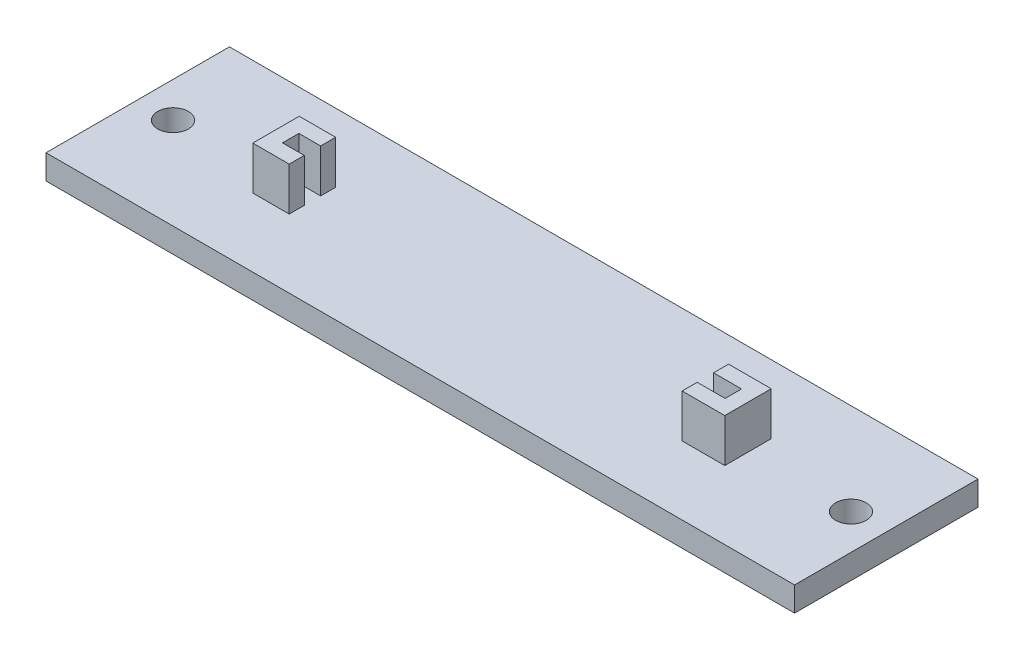
ISO-10303-21;
HEADER;
FILE_DESCRIPTION(('STEP AP214'),'2;1');
FILE_NAME('part.step','',(''),(''),'','','');
FILE_SCHEMA(('AUTOMOTIVE_DESIGN { 1 0 10303 214 1 1 1 1 }'));
ENDSEC;
DATA;
#1=APPLICATION_CONTEXT('core data for automotive mechanical design processes');
#2=APPLICATION_PROTOCOL_DEFINITION('international standard','automotive_design',2000,#1);
#3=PRODUCT_CONTEXT('',#1,'mechanical');
#4=PRODUCT('Part','Part','',(#3));
#5=PRODUCT_RELATED_PRODUCT_CATEGORY('part','',(#4));
#6=PRODUCT_DEFINITION_FORMATION('','',#4);
#7=PRODUCT_DEFINITION_CONTEXT('part definition',#1,'design');
#8=PRODUCT_DEFINITION('design','',#6,#7);
#9=PRODUCT_DEFINITION_SHAPE('','',#8);
#10=(LENGTH_UNIT() NAMED_UNIT(*) SI_UNIT(.MILLI.,.METRE.));
#11=(NAMED_UNIT(*) PLANE_ANGLE_UNIT() SI_UNIT($,.RADIAN.));
#12=(NAMED_UNIT(*) SI_UNIT($,.STERADIAN.) SOLID_ANGLE_UNIT());
#13=UNCERTAINTY_MEASURE_WITH_UNIT(LENGTH_MEASURE(1.E-05),#10,'distance_accuracy_value','');
#14=(GEOMETRIC_REPRESENTATION_CONTEXT(3) GLOBAL_UNCERTAINTY_ASSIGNED_CONTEXT((#13)) GLOBAL_UNIT_ASSIGNED_CONTEXT((#10,
#11,#12)) REPRESENTATION_CONTEXT('',''));
#15=CARTESIAN_POINT('',(0.,0.,0.));
#16=DIRECTION('',(0.,0.,1.));
#17=DIRECTION('',(1.,0.,0.));
#18=AXIS2_PLACEMENT_3D('',#15,#16,#17);
#19=CARTESIAN_POINT('',(-24.511,7.0358,-2.413));
#20=DIRECTION('',(0.,0.,1.));
#21=DIRECTION('',(1.,0.,0.));
#22=AXIS2_PLACEMENT_3D('',#19,#20,#21);
#23=PLANE('',#22);
#24=DIRECTION('',(-1.,0.,0.));
#25=VECTOR('',#24,1.);
#26=CARTESIAN_POINT('',(-24.511,7.0358,-2.413));
#27=LINE('',#26,#25);
#28=CARTESIAN_POINT('',(-20.7264,7.0358,-2.413));
#29=VERTEX_POINT('',#28);
#30=CARTESIAN_POINT('',(-24.511,7.0358,-2.413));
#31=VERTEX_POINT('',#30);
#32=EDGE_CURVE('E351',#29,#31,#27,.T.);
#33=ORIENTED_EDGE('',*,*,#32,.F.);
#34=DIRECTION('',(0.,1.,0.));
#35=VECTOR('',#34,1.);
#36=CARTESIAN_POINT('',(-20.7264,2.54,-2.413));
#37=LINE('',#36,#35);
#38=CARTESIAN_POINT('',(-20.7264,2.54,-2.413));
#39=VERTEX_POINT('',#38);
#40=EDGE_CURVE('E410',#39,#29,#37,.T.);
#41=ORIENTED_EDGE('',*,*,#40,.F.);
#42=DIRECTION('',(-1.,0.,0.));
#43=VECTOR('',#42,1.);
#44=CARTESIAN_POINT('',(-24.511,2.54,-2.413));
#45=LINE('',#44,#43);
#46=CARTESIAN_POINT('',(-24.511,2.54,-2.413));
#47=VERTEX_POINT('',#46);
#48=EDGE_CURVE('E336',#39,#47,#45,.T.);
#49=ORIENTED_EDGE('',*,*,#48,.T.);
#50=DIRECTION('',(0.,-1.,0.));
#51=VECTOR('',#50,1.);
#52=CARTESIAN_POINT('',(-24.511,7.0358,-2.413));
#53=LINE('',#52,#51);
#54=EDGE_CURVE('E220',#31,#47,#53,.T.);
#55=ORIENTED_EDGE('',*,*,#54,.F.);
#56=EDGE_LOOP('',(#33,#41,#49,#55));
#57=FACE_BOUND('',#56,.T.);
#58=ADVANCED_FACE('F39',(#57),#23,.F.);
#59=CARTESIAN_POINT('',(-24.511,7.0358,2.413));
#60=DIRECTION('',(0.,0.,-1.));
#61=DIRECTION('',(-1.,0.,0.));
#62=AXIS2_PLACEMENT_3D('',#59,#60,#61);
#63=PLANE('',#62);
#64=DIRECTION('',(1.,0.,0.));
#65=VECTOR('',#64,1.);
#66=CARTESIAN_POINT('',(-24.511,2.54,2.413));
#67=LINE('',#66,#65);
#68=CARTESIAN_POINT('',(-24.511,2.54,2.413));
#69=VERTEX_POINT('',#68);
#70=CARTESIAN_POINT('',(-20.7264,2.54,2.413));
#71=VERTEX_POINT('',#70);
#72=EDGE_CURVE('E201',#69,#71,#67,.T.);
#73=ORIENTED_EDGE('',*,*,#72,.T.);
#74=DIRECTION('',(0.,1.,0.));
#75=VECTOR('',#74,1.);
#76=CARTESIAN_POINT('',(-20.7264,2.54,2.413));
#77=LINE('',#76,#75);
#78=CARTESIAN_POINT('',(-20.7264,7.0358,2.413));
#79=VERTEX_POINT('',#78);
#80=EDGE_CURVE('E388',#71,#79,#77,.T.);
#81=ORIENTED_EDGE('',*,*,#80,.T.);
#82=DIRECTION('',(1.,0.,0.));
#83=VECTOR('',#82,1.);
#84=CARTESIAN_POINT('',(-24.511,7.0358,2.413));
#85=LINE('',#84,#83);
#86=CARTESIAN_POINT('',(-24.511,7.0358,2.413));
#87=VERTEX_POINT('',#86);
#88=EDGE_CURVE('E217',#87,#79,#85,.T.);
#89=ORIENTED_EDGE('',*,*,#88,.F.);
#90=DIRECTION('',(0.,-1.,0.));
#91=VECTOR('',#90,1.);
#92=CARTESIAN_POINT('',(-24.511,7.0358,2.413));
#93=LINE('',#92,#91);
#94=EDGE_CURVE('E216',#87,#69,#93,.T.);
#95=ORIENTED_EDGE('',*,*,#94,.T.);
#96=EDGE_LOOP('',(#73,#81,#89,#95));
#97=FACE_BOUND('',#96,.T.);
#98=ADVANCED_FACE('F305',(#97),#63,.F.);
#99=CARTESIAN_POINT('',(0.,7.0358,0.));
#100=DIRECTION('',(0.,1.,0.));
#101=DIRECTION('',(0.,0.,1.));
#102=AXIS2_PLACEMENT_3D('',#99,#100,#101);
#103=PLANE('',#102);
#104=DIRECTION('',(0.,0.,1.));
#105=VECTOR('',#104,1.);
#106=CARTESIAN_POINT('',(-20.7264,7.0358,2.413));
#107=LINE('',#106,#105);
#108=CARTESIAN_POINT('',(-20.7264,7.0358,0.8509));
#109=VERTEX_POINT('',#108);
#110=EDGE_CURVE('E184',#109,#79,#107,.T.);
#111=ORIENTED_EDGE('',*,*,#110,.F.);
#112=DIRECTION('',(1.,0.,0.));
#113=VECTOR('',#112,1.);
#114=CARTESIAN_POINT('',(-22.987,7.0358,0.8509));
#115=LINE('',#114,#113);
#116=CARTESIAN_POINT('',(-22.987,7.0358,0.8509));
#117=VERTEX_POINT('',#116);
#118=EDGE_CURVE('E370',#117,#109,#115,.T.);
#119=ORIENTED_EDGE('',*,*,#118,.F.);
#120=DIRECTION('',(0.,0.,1.));
#121=VECTOR('',#120,1.);
#122=CARTESIAN_POINT('',(-22.987,7.0358,-0.8509));
#123=LINE('',#122,#121);
#124=CARTESIAN_POINT('',(-22.987,7.0358,-0.8509));
#125=VERTEX_POINT('',#124);
#126=EDGE_CURVE('E376',#125,#117,#123,.T.);
#127=ORIENTED_EDGE('',*,*,#126,.F.);
#128=DIRECTION('',(-1.,0.,0.));
#129=VECTOR('',#128,1.);
#130=CARTESIAN_POINT('',(-22.987,7.0358,-0.8509));
#131=LINE('',#130,#129);
#132=CARTESIAN_POINT('',(-20.7264,7.0358,-0.8509));
#133=VERTEX_POINT('',#132);
#134=EDGE_CURVE('E384',#133,#125,#131,.T.);
#135=ORIENTED_EDGE('',*,*,#134,.F.);
#136=DIRECTION('',(0.,0.,1.));
#137=VECTOR('',#136,1.);
#138=CARTESIAN_POINT('',(-20.7264,7.0358,-0.8509));
#139=LINE('',#138,#137);
#140=EDGE_CURVE('E418',#29,#133,#139,.T.);
#141=ORIENTED_EDGE('',*,*,#140,.F.);
#142=ORIENTED_EDGE('',*,*,#32,.T.);
#143=DIRECTION('',(0.,0.,1.));
#144=VECTOR('',#143,1.);
#145=CARTESIAN_POINT('',(-24.511,7.0358,-2.413));
#146=LINE('',#145,#144);
#147=EDGE_CURVE('E345',#31,#87,#146,.T.);
#148=ORIENTED_EDGE('',*,*,#147,.T.);
#149=ORIENTED_EDGE('',*,*,#88,.T.);
#150=EDGE_LOOP('',(#111,#119,#127,#135,#141,#142,#148,#149));
#151=FACE_BOUND('',#150,.T.);
#152=ADVANCED_FACE('F312',(#151),#103,.T.);
#153=CARTESIAN_POINT('',(-22.987,2.54,0.8509));
#154=DIRECTION('',(0.,0.,1.));
#155=DIRECTION('',(1.,0.,0.));
#156=AXIS2_PLACEMENT_3D('',#153,#154,#155);
#157=PLANE('',#156);
#158=ORIENTED_EDGE('',*,*,#118,.T.);
#159=DIRECTION('',(0.,1.,0.));
#160=VECTOR('',#159,1.);
#161=CARTESIAN_POINT('',(-20.7264,2.54,0.8509));
#162=LINE('',#161,#160);
#163=CARTESIAN_POINT('',(-20.7264,2.54,0.8509));
#164=VERTEX_POINT('',#163);
#165=EDGE_CURVE('E431',#164,#109,#162,.T.);
#166=ORIENTED_EDGE('',*,*,#165,.F.);
#167=DIRECTION('',(1.,0.,0.));
#168=VECTOR('',#167,1.);
#169=CARTESIAN_POINT('',(-22.987,2.54,0.8509));
#170=LINE('',#169,#168);
#171=CARTESIAN_POINT('',(-22.987,2.54,0.8509));
#172=VERTEX_POINT('',#171);
#173=EDGE_CURVE('E360',#172,#164,#170,.T.);
#174=ORIENTED_EDGE('',*,*,#173,.F.);
#175=DIRECTION('',(0.,1.,0.));
#176=VECTOR('',#175,1.);
#177=CARTESIAN_POINT('',(-22.987,2.54,0.8509));
#178=LINE('',#177,#176);
#179=EDGE_CURVE('E364',#172,#117,#178,.T.);
#180=ORIENTED_EDGE('',*,*,#179,.T.);
#181=EDGE_LOOP('',(#158,#166,#174,#180));
#182=FACE_BOUND('',#181,.T.);
#183=ADVANCED_FACE('F497',(#182),#157,.F.);
#184=CARTESIAN_POINT('',(-22.987,2.54,-0.8509));
#185=DIRECTION('',(0.,0.,-1.));
#186=DIRECTION('',(-1.,0.,0.));
#187=AXIS2_PLACEMENT_3D('',#184,#185,#186);
#188=PLANE('',#187);
#189=DIRECTION('',(-1.,0.,0.));
#190=VECTOR('',#189,1.);
#191=CARTESIAN_POINT('',(-22.987,2.54,-0.8509));
#192=LINE('',#191,#190);
#193=CARTESIAN_POINT('',(-20.7264,2.54,-0.8509));
#194=VERTEX_POINT('',#193);
#195=CARTESIAN_POINT('',(-22.987,2.54,-0.8509));
#196=VERTEX_POINT('',#195);
#197=EDGE_CURVE('E401',#194,#196,#192,.T.);
#198=ORIENTED_EDGE('',*,*,#197,.F.);
#199=DIRECTION('',(0.,1.,0.));
#200=VECTOR('',#199,1.);
#201=CARTESIAN_POINT('',(-20.7264,2.54,-0.8509));
#202=LINE('',#201,#200);
#203=EDGE_CURVE('E413',#194,#133,#202,.T.);
#204=ORIENTED_EDGE('',*,*,#203,.T.);
#205=ORIENTED_EDGE('',*,*,#134,.T.);
#206=DIRECTION('',(0.,1.,0.));
#207=VECTOR('',#206,1.);
#208=CARTESIAN_POINT('',(-22.987,2.54,-0.8509));
#209=LINE('',#208,#207);
#210=EDGE_CURVE('E359',#196,#125,#209,.T.);
#211=ORIENTED_EDGE('',*,*,#210,.F.);
#212=EDGE_LOOP('',(#198,#204,#205,#211));
#213=FACE_BOUND('',#212,.T.);
#214=ADVANCED_FACE('F501',(#213),#188,.F.);
#215=CARTESIAN_POINT('',(0.,2.54,0.));
#216=DIRECTION('',(0.,1.,0.));
#217=DIRECTION('',(0.,0.,1.));
#218=AXIS2_PLACEMENT_3D('',#215,#216,#217);
#219=PLANE('',#218);
#220=ORIENTED_EDGE('',*,*,#48,.F.);
#221=DIRECTION('',(0.,0.,1.));
#222=VECTOR('',#221,1.);
#223=CARTESIAN_POINT('',(-20.7264,2.54,-0.8509));
#224=LINE('',#223,#222);
#225=EDGE_CURVE('E63',#39,#194,#224,.T.);
#226=ORIENTED_EDGE('',*,*,#225,.T.);
#227=ORIENTED_EDGE('',*,*,#197,.T.);
#228=DIRECTION('',(0.,0.,1.));
#229=VECTOR('',#228,1.);
#230=CARTESIAN_POINT('',(-22.987,2.54,-0.8509));
#231=LINE('',#230,#229);
#232=EDGE_CURVE('E393',#196,#172,#231,.T.);
#233=ORIENTED_EDGE('',*,*,#232,.T.);
#234=ORIENTED_EDGE('',*,*,#173,.T.);
#235=DIRECTION('',(0.,0.,1.));
#236=VECTOR('',#235,1.);
#237=CARTESIAN_POINT('',(-20.7264,2.54,2.413));
#238=LINE('',#237,#236);
#239=EDGE_CURVE('E183',#164,#71,#238,.T.);
#240=ORIENTED_EDGE('',*,*,#239,.T.);
#241=ORIENTED_EDGE('',*,*,#72,.F.);
#242=DIRECTION('',(0.,0.,1.));
#243=VECTOR('',#242,1.);
#244=CARTESIAN_POINT('',(-24.511,2.54,-2.413));
#245=LINE('',#244,#243);
#246=EDGE_CURVE('E202',#47,#69,#245,.T.);
#247=ORIENTED_EDGE('',*,*,#246,.F.);
#248=EDGE_LOOP('',(#220,#226,#227,#233,#234,#240,#241,#247));
#249=FACE_BOUND('',#248,.T.);
#250=CARTESIAN_POINT('',(35.2047,2.54,0.));
#251=DIRECTION('',(0.,1.,0.));
#252=DIRECTION('',(0.,0.,1.));
#253=AXIS2_PLACEMENT_3D('',#250,#251,#252);
#254=CIRCLE('',#253,1.5875);
#255=CARTESIAN_POINT('',(35.2047,2.54,1.5875));
#256=VERTEX_POINT('',#255);
#257=EDGE_CURVE('E233',#256,#256,#254,.T.);
#258=ORIENTED_EDGE('',*,*,#257,.F.);
#259=EDGE_LOOP('',(#258));
#260=FACE_BOUND('',#259,.T.);
#261=CARTESIAN_POINT('',(-35.2047,2.54,0.));
#262=DIRECTION('',(0.,1.,0.));
#263=DIRECTION('',(0.,0.,1.));
#264=AXIS2_PLACEMENT_3D('',#261,#262,#263);
#265=CIRCLE('',#264,1.5875);
#266=CARTESIAN_POINT('',(-35.2047,2.54,1.5875));
#267=VERTEX_POINT('',#266);
#268=EDGE_CURVE('E227',#267,#267,#265,.T.);
#269=ORIENTED_EDGE('',*,*,#268,.F.);
#270=EDGE_LOOP('',(#269));
#271=FACE_BOUND('',#270,.T.);
#272=DIRECTION('',(0.,0.,-1.));
#273=VECTOR('',#272,1.);
#274=CARTESIAN_POINT('',(38.875,2.54,-9.52500000000001));
#275=LINE('',#274,#273);
#276=CARTESIAN_POINT('',(38.875,2.54,9.525));
#277=VERTEX_POINT('',#276);
#278=CARTESIAN_POINT('',(38.875,2.54,-9.52500000000001));
#279=VERTEX_POINT('',#278);
#280=EDGE_CURVE('E244',#277,#279,#275,.T.);
#281=ORIENTED_EDGE('',*,*,#280,.T.);
#282=DIRECTION('',(-1.,0.,0.));
#283=VECTOR('',#282,1.);
#284=CARTESIAN_POINT('',(-38.875,2.54,-9.52500000000001));
#285=LINE('',#284,#283);
#286=CARTESIAN_POINT('',(-38.875,2.54,-9.52500000000001));
#287=VERTEX_POINT('',#286);
#288=EDGE_CURVE('E248',#279,#287,#285,.T.);
#289=ORIENTED_EDGE('',*,*,#288,.T.);
#290=DIRECTION('',(0.,0.,1.));
#291=VECTOR('',#290,1.);
#292=CARTESIAN_POINT('',(-38.875,2.54,-9.52500000000001));
#293=LINE('',#292,#291);
#294=CARTESIAN_POINT('',(-38.875,2.54,9.525));
#295=VERTEX_POINT('',#294);
#296=EDGE_CURVE('E252',#287,#295,#293,.T.);
#297=ORIENTED_EDGE('',*,*,#296,.T.);
#298=DIRECTION('',(1.,0.,0.));
#299=VECTOR('',#298,1.);
#300=CARTESIAN_POINT('',(-38.875,2.54,9.525));
#301=LINE('',#300,#299);
#302=EDGE_CURVE('E255',#295,#277,#301,.T.);
#303=ORIENTED_EDGE('',*,*,#302,.T.);
#304=EDGE_LOOP('',(#281,#289,#297,#303));
#305=FACE_BOUND('',#304,.T.);
#306=CARTESIAN_POINT('',(24.511,2.54,-2.413));
#307=VERTEX_POINT('',#306);
#308=CARTESIAN_POINT('',(20.0843889128596,2.54,-2.413));
#309=VERTEX_POINT('',#308);
#310=EDGE_CURVE('E209',#307,#309,#45,.T.);
#311=ORIENTED_EDGE('',*,*,#310,.F.);
#312=DIRECTION('',(0.,0.,-1.));
#313=VECTOR('',#312,1.);
#314=CARTESIAN_POINT('',(24.511,2.54,-2.413));
#315=LINE('',#314,#313);
#316=CARTESIAN_POINT('',(24.511,2.54,2.413));
#317=VERTEX_POINT('',#316);
#318=EDGE_CURVE('E199',#317,#307,#315,.T.);
#319=ORIENTED_EDGE('',*,*,#318,.F.);
#320=CARTESIAN_POINT('',(20.0843889128596,2.54,2.413));
#321=VERTEX_POINT('',#320);
#322=EDGE_CURVE('E190',#321,#317,#67,.T.);
#323=ORIENTED_EDGE('',*,*,#322,.F.);
#324=DIRECTION('',(0.,0.,-1.));
#325=VECTOR('',#324,1.);
#326=CARTESIAN_POINT('',(20.0843889128596,2.54,2.413));
#327=LINE('',#326,#325);
#328=CARTESIAN_POINT('',(20.0843889128596,2.54,0.8509));
#329=VERTEX_POINT('',#328);
#330=EDGE_CURVE('E55',#321,#329,#327,.T.);
#331=ORIENTED_EDGE('',*,*,#330,.T.);
#332=CARTESIAN_POINT('',(22.987,2.54,0.8509));
#333=VERTEX_POINT('',#332);
#334=EDGE_CURVE('E392',#329,#333,#170,.T.);
#335=ORIENTED_EDGE('',*,*,#334,.T.);
#336=DIRECTION('',(0.,0.,-1.));
#337=VECTOR('',#336,1.);
#338=CARTESIAN_POINT('',(22.987,2.54,-0.8509));
#339=LINE('',#338,#337);
#340=CARTESIAN_POINT('',(22.987,2.54,-0.8509));
#341=VERTEX_POINT('',#340);
#342=EDGE_CURVE('E374',#333,#341,#339,.T.);
#343=ORIENTED_EDGE('',*,*,#342,.T.);
#344=CARTESIAN_POINT('',(20.0843889128596,2.54,-0.8509));
#345=VERTEX_POINT('',#344);
#346=EDGE_CURVE('E397',#341,#345,#192,.T.);
#347=ORIENTED_EDGE('',*,*,#346,.T.);
#348=DIRECTION('',(0.,0.,-1.));
#349=VECTOR('',#348,1.);
#350=CARTESIAN_POINT('',(20.0843889128596,2.54,-2.413));
#351=LINE('',#350,#349);
#352=EDGE_CURVE('E421',#345,#309,#351,.T.);
#353=ORIENTED_EDGE('',*,*,#352,.T.);
#354=EDGE_LOOP('',(#311,#319,#323,#331,#335,#343,#347,#353));
#355=FACE_BOUND('',#354,.T.);
#356=ADVANCED_FACE('F197',(#249,#260,#271,#305,#355),#219,.T.);
#357=CARTESIAN_POINT('',(38.875,2.54,-9.52500000000001));
#358=DIRECTION('',(-1.,0.,0.));
#359=DIRECTION('',(0.,0.,1.));
#360=AXIS2_PLACEMENT_3D('',#357,#358,#359);
#361=PLANE('',#360);
#362=DIRECTION('',(0.,0.,-1.));
#363=VECTOR('',#362,1.);
#364=CARTESIAN_POINT('',(38.875,0.,-9.52500000000001));
#365=LINE('',#364,#363);
#366=CARTESIAN_POINT('',(38.875,0.,9.525));
#367=VERTEX_POINT('',#366);
#368=CARTESIAN_POINT('',(38.875,0.,-9.52500000000001));
#369=VERTEX_POINT('',#368);
#370=EDGE_CURVE('E232',#367,#369,#365,.T.);
#371=ORIENTED_EDGE('',*,*,#370,.T.);
#372=DIRECTION('',(0.,-1.,0.));
#373=VECTOR('',#372,1.);
#374=CARTESIAN_POINT('',(38.875,2.54,-9.52500000000001));
#375=LINE('',#374,#373);
#376=EDGE_CURVE('E11',#279,#369,#375,.T.);
#377=ORIENTED_EDGE('',*,*,#376,.F.);
#378=ORIENTED_EDGE('',*,*,#280,.F.);
#379=DIRECTION('',(0.,-1.,0.));
#380=VECTOR('',#379,1.);
#381=CARTESIAN_POINT('',(38.875,2.54,9.525));
#382=LINE('',#381,#380);
#383=EDGE_CURVE('E258',#277,#367,#382,.T.);
#384=ORIENTED_EDGE('',*,*,#383,.T.);
#385=EDGE_LOOP('',(#371,#377,#378,#384));
#386=FACE_BOUND('',#385,.T.);
#387=ADVANCED_FACE('F41',(#386),#361,.F.);
#388=CARTESIAN_POINT('',(-38.875,2.54,-9.52500000000001));
#389=DIRECTION('',(0.,0.,1.));
#390=DIRECTION('',(1.,0.,0.));
#391=AXIS2_PLACEMENT_3D('',#388,#389,#390);
#392=PLANE('',#391);
#393=DIRECTION('',(-1.,0.,0.));
#394=VECTOR('',#393,1.);
#395=CARTESIAN_POINT('',(-38.875,0.,-9.52500000000001));
#396=LINE('',#395,#394);
#397=CARTESIAN_POINT('',(-38.875,0.,-9.52500000000001));
#398=VERTEX_POINT('',#397);
#399=EDGE_CURVE('E262',#369,#398,#396,.T.);
#400=ORIENTED_EDGE('',*,*,#399,.T.);
#401=DIRECTION('',(0.,-1.,0.));
#402=VECTOR('',#401,1.);
#403=CARTESIAN_POINT('',(-38.875,2.54,-9.52500000000001));
#404=LINE('',#403,#402);
#405=EDGE_CURVE('E48',#287,#398,#404,.T.);
#406=ORIENTED_EDGE('',*,*,#405,.F.);
#407=ORIENTED_EDGE('',*,*,#288,.F.);
#408=ORIENTED_EDGE('',*,*,#376,.T.);
#409=EDGE_LOOP('',(#400,#406,#407,#408));
#410=FACE_BOUND('',#409,.T.);
#411=ADVANCED_FACE('F297',(#410),#392,.F.);
#412=CARTESIAN_POINT('',(-38.875,2.54,-9.52500000000001));
#413=DIRECTION('',(1.,0.,0.));
#414=DIRECTION('',(0.,0.,-1.));
#415=AXIS2_PLACEMENT_3D('',#412,#413,#414);
#416=PLANE('',#415);
#417=DIRECTION('',(0.,0.,1.));
#418=VECTOR('',#417,1.);
#419=CARTESIAN_POINT('',(-38.875,0.,-9.52500000000001));
#420=LINE('',#419,#418);
#421=CARTESIAN_POINT('',(-38.875,0.,9.525));
#422=VERTEX_POINT('',#421);
#423=EDGE_CURVE('E265',#398,#422,#420,.T.);
#424=ORIENTED_EDGE('',*,*,#423,.T.);
#425=DIRECTION('',(0.,-1.,0.));
#426=VECTOR('',#425,1.);
#427=CARTESIAN_POINT('',(-38.875,2.54,9.525));
#428=LINE('',#427,#426);
#429=EDGE_CURVE('E273',#295,#422,#428,.T.);
#430=ORIENTED_EDGE('',*,*,#429,.F.);
#431=ORIENTED_EDGE('',*,*,#296,.F.);
#432=ORIENTED_EDGE('',*,*,#405,.T.);
#433=EDGE_LOOP('',(#424,#430,#431,#432));
#434=FACE_BOUND('',#433,.T.);
#435=ADVANCED_FACE('F282',(#434),#416,.F.);
#436=CARTESIAN_POINT('',(-38.875,2.54,9.525));
#437=DIRECTION('',(0.,0.,-1.));
#438=DIRECTION('',(-1.,0.,0.));
#439=AXIS2_PLACEMENT_3D('',#436,#437,#438);
#440=PLANE('',#439);
#441=DIRECTION('',(1.,0.,0.));
#442=VECTOR('',#441,1.);
#443=CARTESIAN_POINT('',(-38.875,0.,9.525));
#444=LINE('',#443,#442);
#445=EDGE_CURVE('E249',#422,#367,#444,.T.);
#446=ORIENTED_EDGE('',*,*,#445,.T.);
#447=ORIENTED_EDGE('',*,*,#383,.F.);
#448=ORIENTED_EDGE('',*,*,#302,.F.);
#449=ORIENTED_EDGE('',*,*,#429,.T.);
#450=EDGE_LOOP('',(#446,#447,#448,#449));
#451=FACE_BOUND('',#450,.T.);
#452=ADVANCED_FACE('F291',(#451),#440,.F.);
#453=CARTESIAN_POINT('',(0.,0.,0.));
#454=DIRECTION('',(0.,1.,0.));
#455=DIRECTION('',(0.,0.,1.));
#456=AXIS2_PLACEMENT_3D('',#453,#454,#455);
#457=PLANE('',#456);
#458=CARTESIAN_POINT('',(35.2047,0.,0.));
#459=DIRECTION('',(0.,1.,0.));
#460=DIRECTION('',(0.,0.,1.));
#461=AXIS2_PLACEMENT_3D('',#458,#459,#460);
#462=CIRCLE('',#461,1.5875);
#463=CARTESIAN_POINT('',(35.2047,0.,1.5875));
#464=VERTEX_POINT('',#463);
#465=EDGE_CURVE('E228',#464,#464,#462,.T.);
#466=ORIENTED_EDGE('',*,*,#465,.T.);
#467=EDGE_LOOP('',(#466));
#468=FACE_BOUND('',#467,.T.);
#469=CARTESIAN_POINT('',(-35.2047,0.,0.));
#470=DIRECTION('',(0.,1.,0.));
#471=DIRECTION('',(0.,0.,1.));
#472=AXIS2_PLACEMENT_3D('',#469,#470,#471);
#473=CIRCLE('',#472,1.5875);
#474=CARTESIAN_POINT('',(-35.2047,0.,1.5875));
#475=VERTEX_POINT('',#474);
#476=EDGE_CURVE('E237',#475,#475,#473,.T.);
#477=ORIENTED_EDGE('',*,*,#476,.T.);
#478=EDGE_LOOP('',(#477));
#479=FACE_BOUND('',#478,.T.);
#480=ORIENTED_EDGE('',*,*,#370,.F.);
#481=ORIENTED_EDGE('',*,*,#445,.F.);
#482=ORIENTED_EDGE('',*,*,#423,.F.);
#483=ORIENTED_EDGE('',*,*,#399,.F.);
#484=EDGE_LOOP('',(#480,#481,#482,#483));
#485=FACE_BOUND('',#484,.T.);
#486=ADVANCED_FACE('F288',(#468,#479,#485),#457,.F.);
#487=CARTESIAN_POINT('',(-35.2047,0.,0.));
#488=DIRECTION('',(0.,1.,0.));
#489=DIRECTION('',(0.,0.,1.));
#490=AXIS2_PLACEMENT_3D('',#487,#488,#489);
#491=CYLINDRICAL_SURFACE('',#490,1.5875);
#492=ORIENTED_EDGE('',*,*,#476,.F.);
#493=EDGE_LOOP('',(#492));
#494=FACE_BOUND('',#493,.T.);
#495=ORIENTED_EDGE('',*,*,#268,.T.);
#496=EDGE_LOOP('',(#495));
#497=FACE_BOUND('',#496,.T.);
#498=ADVANCED_FACE('F637',(#494,#497),#491,.F.);
#499=CARTESIAN_POINT('',(35.2047,0.,0.));
#500=DIRECTION('',(0.,1.,0.));
#501=DIRECTION('',(0.,0.,1.));
#502=AXIS2_PLACEMENT_3D('',#499,#500,#501);
#503=CYLINDRICAL_SURFACE('',#502,1.5875);
#504=ORIENTED_EDGE('',*,*,#465,.F.);
#505=EDGE_LOOP('',(#504));
#506=FACE_BOUND('',#505,.T.);
#507=ORIENTED_EDGE('',*,*,#257,.T.);
#508=EDGE_LOOP('',(#507));
#509=FACE_BOUND('',#508,.T.);
#510=ADVANCED_FACE('F327',(#506,#509),#503,.F.);
#511=CARTESIAN_POINT('',(24.511,7.0358,-2.413));
#512=DIRECTION('',(-1.,0.,0.));
#513=DIRECTION('',(0.,0.,1.));
#514=AXIS2_PLACEMENT_3D('',#511,#512,#513);
#515=PLANE('',#514);
#516=ORIENTED_EDGE('',*,*,#318,.T.);
#517=DIRECTION('',(0.,-1.,0.));
#518=VECTOR('',#517,1.);
#519=CARTESIAN_POINT('',(24.511,7.0358,-2.413));
#520=LINE('',#519,#518);
#521=CARTESIAN_POINT('',(24.511,7.0358,-2.413));
#522=VERTEX_POINT('',#521);
#523=EDGE_CURVE('E224',#522,#307,#520,.T.);
#524=ORIENTED_EDGE('',*,*,#523,.F.);
#525=DIRECTION('',(0.,0.,-1.));
#526=VECTOR('',#525,1.);
#527=CARTESIAN_POINT('',(24.511,7.0358,-2.413));
#528=LINE('',#527,#526);
#529=CARTESIAN_POINT('',(24.511,7.0358,2.413));
#530=VERTEX_POINT('',#529);
#531=EDGE_CURVE('E207',#530,#522,#528,.T.);
#532=ORIENTED_EDGE('',*,*,#531,.F.);
#533=DIRECTION('',(0.,-1.,0.));
#534=VECTOR('',#533,1.);
#535=CARTESIAN_POINT('',(24.511,7.0358,2.413));
#536=LINE('',#535,#534);
#537=EDGE_CURVE('E213',#530,#317,#536,.T.);
#538=ORIENTED_EDGE('',*,*,#537,.T.);
#539=EDGE_LOOP('',(#516,#524,#532,#538));
#540=FACE_BOUND('',#539,.T.);
#541=ADVANCED_FACE('F320',(#540),#515,.F.);
#542=ORIENTED_EDGE('',*,*,#310,.T.);
#543=DIRECTION('',(0.,1.,0.));
#544=VECTOR('',#543,1.);
#545=CARTESIAN_POINT('',(20.0843889128596,2.54,-2.413));
#546=LINE('',#545,#544);
#547=CARTESIAN_POINT('',(20.0843889128596,7.0358,-2.413));
#548=VERTEX_POINT('',#547);
#549=EDGE_CURVE('E331',#309,#548,#546,.T.);
#550=ORIENTED_EDGE('',*,*,#549,.T.);
#551=EDGE_CURVE('E348',#522,#548,#27,.T.);
#552=ORIENTED_EDGE('',*,*,#551,.F.);
#553=ORIENTED_EDGE('',*,*,#523,.T.);
#554=EDGE_LOOP('',(#542,#550,#552,#553));
#555=FACE_BOUND('',#554,.T.);
#556=ADVANCED_FACE('F308',(#555),#23,.F.);
#557=CARTESIAN_POINT('',(-24.511,7.0358,-2.413));
#558=DIRECTION('',(1.,0.,0.));
#559=DIRECTION('',(0.,0.,-1.));
#560=AXIS2_PLACEMENT_3D('',#557,#558,#559);
#561=PLANE('',#560);
#562=ORIENTED_EDGE('',*,*,#246,.T.);
#563=ORIENTED_EDGE('',*,*,#94,.F.);
#564=ORIENTED_EDGE('',*,*,#147,.F.);
#565=ORIENTED_EDGE('',*,*,#54,.T.);
#566=EDGE_LOOP('',(#562,#563,#564,#565));
#567=FACE_BOUND('',#566,.T.);
#568=ADVANCED_FACE('F319',(#567),#561,.F.);
#569=CARTESIAN_POINT('',(20.0843889128596,7.0358,2.413));
#570=VERTEX_POINT('',#569);
#571=EDGE_CURVE('E192',#570,#530,#85,.T.);
#572=ORIENTED_EDGE('',*,*,#571,.F.);
#573=DIRECTION('',(0.,1.,0.));
#574=VECTOR('',#573,1.);
#575=CARTESIAN_POINT('',(20.0843889128596,2.54,2.413));
#576=LINE('',#575,#574);
#577=EDGE_CURVE('E177',#321,#570,#576,.T.);
#578=ORIENTED_EDGE('',*,*,#577,.F.);
#579=ORIENTED_EDGE('',*,*,#322,.T.);
#580=ORIENTED_EDGE('',*,*,#537,.F.);
#581=EDGE_LOOP('',(#572,#578,#579,#580));
#582=FACE_BOUND('',#581,.T.);
#583=ADVANCED_FACE('F188',(#582),#63,.F.);
#584=DIRECTION('',(0.,0.,-1.));
#585=VECTOR('',#584,1.);
#586=CARTESIAN_POINT('',(20.0843889128596,7.0358,2.413));
#587=LINE('',#586,#585);
#588=CARTESIAN_POINT('',(20.0843889128596,7.0358,0.8509));
#589=VERTEX_POINT('',#588);
#590=EDGE_CURVE('E417',#570,#589,#587,.T.);
#591=ORIENTED_EDGE('',*,*,#590,.F.);
#592=ORIENTED_EDGE('',*,*,#571,.T.);
#593=ORIENTED_EDGE('',*,*,#531,.T.);
#594=ORIENTED_EDGE('',*,*,#551,.T.);
#595=DIRECTION('',(0.,0.,-1.));
#596=VECTOR('',#595,1.);
#597=CARTESIAN_POINT('',(20.0843889128596,7.0358,-2.413));
#598=LINE('',#597,#596);
#599=CARTESIAN_POINT('',(20.0843889128596,7.0358,-0.8509));
#600=VERTEX_POINT('',#599);
#601=EDGE_CURVE('E422',#600,#548,#598,.T.);
#602=ORIENTED_EDGE('',*,*,#601,.F.);
#603=CARTESIAN_POINT('',(22.987,7.0358,-0.8509));
#604=VERTEX_POINT('',#603);
#605=EDGE_CURVE('E380',#604,#600,#131,.T.);
#606=ORIENTED_EDGE('',*,*,#605,.F.);
#607=DIRECTION('',(0.,0.,-1.));
#608=VECTOR('',#607,1.);
#609=CARTESIAN_POINT('',(22.987,7.0358,-0.8509));
#610=LINE('',#609,#608);
#611=CARTESIAN_POINT('',(22.987,7.0358,0.8509));
#612=VERTEX_POINT('',#611);
#613=EDGE_CURVE('E385',#612,#604,#610,.T.);
#614=ORIENTED_EDGE('',*,*,#613,.F.);
#615=EDGE_CURVE('E375',#589,#612,#115,.T.);
#616=ORIENTED_EDGE('',*,*,#615,.F.);
#617=EDGE_LOOP('',(#591,#592,#593,#594,#602,#606,#614,#616));
#618=FACE_BOUND('',#617,.T.);
#619=ADVANCED_FACE('F485',(#618),#103,.T.);
#620=CARTESIAN_POINT('',(22.987,2.54,-0.8509));
#621=DIRECTION('',(1.,0.,0.));
#622=DIRECTION('',(0.,0.,-1.));
#623=AXIS2_PLACEMENT_3D('',#620,#621,#622);
#624=PLANE('',#623);
#625=ORIENTED_EDGE('',*,*,#613,.T.);
#626=DIRECTION('',(0.,1.,0.));
#627=VECTOR('',#626,1.);
#628=CARTESIAN_POINT('',(22.987,2.54,-0.8509));
#629=LINE('',#628,#627);
#630=EDGE_CURVE('E355',#341,#604,#629,.T.);
#631=ORIENTED_EDGE('',*,*,#630,.F.);
#632=ORIENTED_EDGE('',*,*,#342,.F.);
#633=DIRECTION('',(0.,1.,0.));
#634=VECTOR('',#633,1.);
#635=CARTESIAN_POINT('',(22.987,2.54,0.8509));
#636=LINE('',#635,#634);
#637=EDGE_CURVE('E341',#333,#612,#636,.T.);
#638=ORIENTED_EDGE('',*,*,#637,.T.);
#639=EDGE_LOOP('',(#625,#631,#632,#638));
#640=FACE_BOUND('',#639,.T.);
#641=ADVANCED_FACE('F475',(#640),#624,.F.);
#642=ORIENTED_EDGE('',*,*,#334,.F.);
#643=DIRECTION('',(0.,1.,0.));
#644=VECTOR('',#643,1.);
#645=CARTESIAN_POINT('',(20.0843889128596,2.54,0.8509));
#646=LINE('',#645,#644);
#647=EDGE_CURVE('E180',#329,#589,#646,.T.);
#648=ORIENTED_EDGE('',*,*,#647,.T.);
#649=ORIENTED_EDGE('',*,*,#615,.T.);
#650=ORIENTED_EDGE('',*,*,#637,.F.);
#651=EDGE_LOOP('',(#642,#648,#649,#650));
#652=FACE_BOUND('',#651,.T.);
#653=ADVANCED_FACE('F471',(#652),#157,.F.);
#654=CARTESIAN_POINT('',(-22.987,2.54,-0.8509));
#655=DIRECTION('',(-1.,0.,0.));
#656=DIRECTION('',(0.,0.,1.));
#657=AXIS2_PLACEMENT_3D('',#654,#655,#656);
#658=PLANE('',#657);
#659=ORIENTED_EDGE('',*,*,#126,.T.);
#660=ORIENTED_EDGE('',*,*,#179,.F.);
#661=ORIENTED_EDGE('',*,*,#232,.F.);
#662=ORIENTED_EDGE('',*,*,#210,.T.);
#663=EDGE_LOOP('',(#659,#660,#661,#662));
#664=FACE_BOUND('',#663,.T.);
#665=ADVANCED_FACE('F511',(#664),#658,.F.);
#666=ORIENTED_EDGE('',*,*,#605,.T.);
#667=DIRECTION('',(0.,1.,0.));
#668=VECTOR('',#667,1.);
#669=CARTESIAN_POINT('',(20.0843889128596,2.54,-0.8509));
#670=LINE('',#669,#668);
#671=EDGE_CURVE('E405',#345,#600,#670,.T.);
#672=ORIENTED_EDGE('',*,*,#671,.F.);
#673=ORIENTED_EDGE('',*,*,#346,.F.);
#674=ORIENTED_EDGE('',*,*,#630,.T.);
#675=EDGE_LOOP('',(#666,#672,#673,#674));
#676=FACE_BOUND('',#675,.T.);
#677=ADVANCED_FACE('F480',(#676),#188,.F.);
#678=CARTESIAN_POINT('',(-20.7264,2.54,-0.8509));
#679=DIRECTION('',(-1.,0.,0.));
#680=DIRECTION('',(0.,0.,1.));
#681=AXIS2_PLACEMENT_3D('',#678,#679,#680);
#682=PLANE('',#681);
#683=ORIENTED_EDGE('',*,*,#140,.T.);
#684=ORIENTED_EDGE('',*,*,#203,.F.);
#685=ORIENTED_EDGE('',*,*,#225,.F.);
#686=ORIENTED_EDGE('',*,*,#40,.T.);
#687=EDGE_LOOP('',(#683,#684,#685,#686));
#688=FACE_BOUND('',#687,.T.);
#689=ADVANCED_FACE('F456',(#688),#682,.F.);
#690=CARTESIAN_POINT('',(20.0843889128596,2.54,-2.413));
#691=DIRECTION('',(1.,0.,0.));
#692=DIRECTION('',(0.,0.,-1.));
#693=AXIS2_PLACEMENT_3D('',#690,#691,#692);
#694=PLANE('',#693);
#695=ORIENTED_EDGE('',*,*,#601,.T.);
#696=ORIENTED_EDGE('',*,*,#549,.F.);
#697=ORIENTED_EDGE('',*,*,#352,.F.);
#698=ORIENTED_EDGE('',*,*,#671,.T.);
#699=EDGE_LOOP('',(#695,#696,#697,#698));
#700=FACE_BOUND('',#699,.T.);
#701=ADVANCED_FACE('F482',(#700),#694,.F.);
#702=CARTESIAN_POINT('',(-20.7264,2.54,2.413));
#703=DIRECTION('',(-1.,0.,0.));
#704=DIRECTION('',(0.,0.,1.));
#705=AXIS2_PLACEMENT_3D('',#702,#703,#704);
#706=PLANE('',#705);
#707=ORIENTED_EDGE('',*,*,#110,.T.);
#708=ORIENTED_EDGE('',*,*,#80,.F.);
#709=ORIENTED_EDGE('',*,*,#239,.F.);
#710=ORIENTED_EDGE('',*,*,#165,.T.);
#711=EDGE_LOOP('',(#707,#708,#709,#710));
#712=FACE_BOUND('',#711,.T.);
#713=ADVANCED_FACE('F520',(#712),#706,.F.);
#714=CARTESIAN_POINT('',(20.0843889128596,2.54,2.413));
#715=DIRECTION('',(1.,0.,0.));
#716=DIRECTION('',(0.,0.,-1.));
#717=AXIS2_PLACEMENT_3D('',#714,#715,#716);
#718=PLANE('',#717);
#719=ORIENTED_EDGE('',*,*,#590,.T.);
#720=ORIENTED_EDGE('',*,*,#647,.F.);
#721=ORIENTED_EDGE('',*,*,#330,.F.);
#722=ORIENTED_EDGE('',*,*,#577,.T.);
#723=EDGE_LOOP('',(#719,#720,#721,#722));
#724=FACE_BOUND('',#723,.T.);
#725=ADVANCED_FACE('F176',(#724),#718,.F.);
#726=CLOSED_SHELL('',(#58,#98,#152,#183,#214,#356,#387,#411,#435,#452,#486,#498,#510,#541,#556,
#568,#583,#619,#641,#653,#665,#677,#689,#701,#713,#725));
#727=MANIFOLD_SOLID_BREP('B2',#726);
#728=ADVANCED_BREP_SHAPE_REPRESENTATION('',(#18,#727),#14);
#729=SHAPE_DEFINITION_REPRESENTATION(#9,#728);
ENDSEC;
END-ISO-10303-21;
